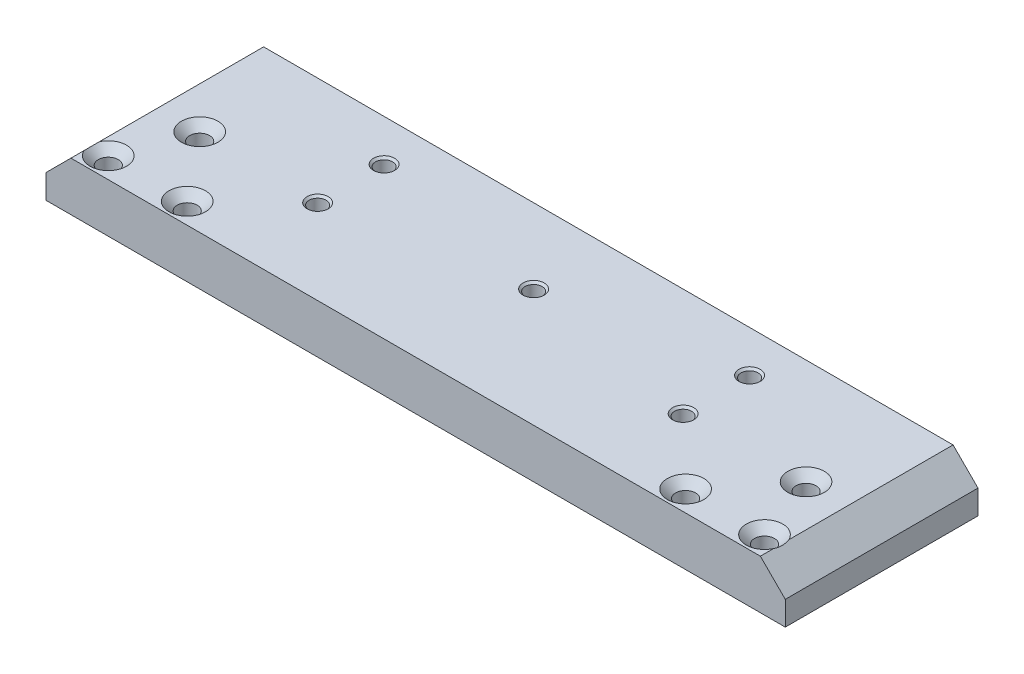
ISO-10303-21;
HEADER;
FILE_DESCRIPTION(('STEP AP214'),'2;1');
FILE_NAME('part.step','',(''),(''),'','','');
FILE_SCHEMA(('AUTOMOTIVE_DESIGN { 1 0 10303 214 1 1 1 1 }'));
ENDSEC;
DATA;
#1=APPLICATION_CONTEXT('core data for automotive mechanical design processes');
#2=APPLICATION_PROTOCOL_DEFINITION('international standard','automotive_design',2000,#1);
#3=PRODUCT_CONTEXT('',#1,'mechanical');
#4=PRODUCT('Part','Part','',(#3));
#5=PRODUCT_RELATED_PRODUCT_CATEGORY('part','',(#4));
#6=PRODUCT_DEFINITION_FORMATION('','',#4);
#7=PRODUCT_DEFINITION_CONTEXT('part definition',#1,'design');
#8=PRODUCT_DEFINITION('design','',#6,#7);
#9=PRODUCT_DEFINITION_SHAPE('','',#8);
#10=(LENGTH_UNIT() NAMED_UNIT(*) SI_UNIT(.MILLI.,.METRE.));
#11=(NAMED_UNIT(*) PLANE_ANGLE_UNIT() SI_UNIT($,.RADIAN.));
#12=(NAMED_UNIT(*) SI_UNIT($,.STERADIAN.) SOLID_ANGLE_UNIT());
#13=UNCERTAINTY_MEASURE_WITH_UNIT(LENGTH_MEASURE(1.E-05),#10,'distance_accuracy_value','');
#14=(GEOMETRIC_REPRESENTATION_CONTEXT(3) GLOBAL_UNCERTAINTY_ASSIGNED_CONTEXT((#13)) GLOBAL_UNIT_ASSIGNED_CONTEXT((#10,
#11,#12)) REPRESENTATION_CONTEXT('',''));
#15=CARTESIAN_POINT('',(0.,0.,0.));
#16=DIRECTION('',(0.,0.,1.));
#17=DIRECTION('',(1.,0.,0.));
#18=AXIS2_PLACEMENT_3D('',#15,#16,#17);
#19=CARTESIAN_POINT('',(-44.5000000000001,-1.9,11.6));
#20=DIRECTION('',(-1.,0.,0.));
#21=DIRECTION('',(0.,0.,1.));
#22=AXIS2_PLACEMENT_3D('',#19,#20,#21);
#23=PLANE('',#22);
#24=DIRECTION('',(0.,0.,1.));
#25=VECTOR('',#24,1.);
#26=CARTESIAN_POINT('',(-44.5000000000001,1.,-15.8426406871193));
#27=LINE('',#26,#25);
#28=CARTESIAN_POINT('',(-44.5000000000001,1.,-11.6));
#29=VERTEX_POINT('',#28);
#30=CARTESIAN_POINT('',(-44.5000000000001,1.,11.6));
#31=VERTEX_POINT('',#30);
#32=EDGE_CURVE('E109',#29,#31,#27,.T.);
#33=ORIENTED_EDGE('',*,*,#32,.F.);
#34=DIRECTION('',(0.,1.,0.));
#35=VECTOR('',#34,1.);
#36=CARTESIAN_POINT('',(-44.5000000000001,-1.9,-11.6));
#37=LINE('',#36,#35);
#38=CARTESIAN_POINT('',(-44.5000000000001,-1.9,-11.6));
#39=VERTEX_POINT('',#38);
#40=EDGE_CURVE('E122',#39,#29,#37,.T.);
#41=ORIENTED_EDGE('',*,*,#40,.F.);
#42=DIRECTION('',(0.,0.,1.));
#43=VECTOR('',#42,1.);
#44=CARTESIAN_POINT('',(-44.5000000000001,-1.9,11.6));
#45=LINE('',#44,#43);
#46=CARTESIAN_POINT('',(-44.5000000000001,-1.9,11.6));
#47=VERTEX_POINT('',#46);
#48=EDGE_CURVE('E359',#39,#47,#45,.T.);
#49=ORIENTED_EDGE('',*,*,#48,.T.);
#50=DIRECTION('',(0.,1.,0.));
#51=VECTOR('',#50,1.);
#52=CARTESIAN_POINT('',(-44.5000000000001,-1.9,11.6));
#53=LINE('',#52,#51);
#54=EDGE_CURVE('E124',#47,#31,#53,.T.);
#55=ORIENTED_EDGE('',*,*,#54,.T.);
#56=EDGE_LOOP('',(#33,#41,#49,#55));
#57=FACE_BOUND('',#56,.T.);
#58=ADVANCED_FACE('F38',(#57),#23,.T.);
#59=CARTESIAN_POINT('',(44.4999999999999,-1.9,-11.6));
#60=DIRECTION('',(0.,0.,-1.));
#61=DIRECTION('',(-1.,0.,0.));
#62=AXIS2_PLACEMENT_3D('',#59,#60,#61);
#63=PLANE('',#62);
#64=DIRECTION('',(0.707106781186548,0.707106781186547,0.));
#65=VECTOR('',#64,1.);
#66=CARTESIAN_POINT('',(-44.5000000000001,1.,-11.6));
#67=LINE('',#66,#65);
#68=CARTESIAN_POINT('',(-41.5000000000001,4.,-11.6));
#69=VERTEX_POINT('',#68);
#70=EDGE_CURVE('E106',#29,#69,#67,.T.);
#71=ORIENTED_EDGE('',*,*,#70,.T.);
#72=DIRECTION('',(-1.,0.,0.));
#73=VECTOR('',#72,1.);
#74=CARTESIAN_POINT('',(44.4999999999999,4.,-11.6));
#75=LINE('',#74,#73);
#76=CARTESIAN_POINT('',(41.4999999999999,4.,-11.6));
#77=VERTEX_POINT('',#76);
#78=EDGE_CURVE('E356',#77,#69,#75,.T.);
#79=ORIENTED_EDGE('',*,*,#78,.F.);
#80=DIRECTION('',(0.707106781186548,-0.707106781186547,0.));
#81=VECTOR('',#80,1.);
#82=CARTESIAN_POINT('',(44.4999999999999,1.,-11.6));
#83=LINE('',#82,#81);
#84=CARTESIAN_POINT('',(44.4999999999999,1.,-11.6));
#85=VERTEX_POINT('',#84);
#86=EDGE_CURVE('E247',#77,#85,#83,.T.);
#87=ORIENTED_EDGE('',*,*,#86,.T.);
#88=DIRECTION('',(0.,1.,0.));
#89=VECTOR('',#88,1.);
#90=CARTESIAN_POINT('',(44.4999999999999,-1.9,-11.6));
#91=LINE('',#90,#89);
#92=CARTESIAN_POINT('',(44.4999999999999,-1.9,-11.6));
#93=VERTEX_POINT('',#92);
#94=EDGE_CURVE('E133',#93,#85,#91,.T.);
#95=ORIENTED_EDGE('',*,*,#94,.F.);
#96=DIRECTION('',(-1.,0.,0.));
#97=VECTOR('',#96,1.);
#98=CARTESIAN_POINT('',(44.4999999999999,-1.9,-11.6));
#99=LINE('',#98,#97);
#100=EDGE_CURVE('E131',#93,#39,#99,.T.);
#101=ORIENTED_EDGE('',*,*,#100,.T.);
#102=ORIENTED_EDGE('',*,*,#40,.T.);
#103=EDGE_LOOP('',(#71,#79,#87,#95,#101,#102));
#104=FACE_BOUND('',#103,.T.);
#105=ADVANCED_FACE('F129',(#104),#63,.T.);
#106=CARTESIAN_POINT('',(44.4999999999999,-1.9,11.6));
#107=DIRECTION('',(1.,0.,0.));
#108=DIRECTION('',(0.,0.,-1.));
#109=AXIS2_PLACEMENT_3D('',#106,#107,#108);
#110=PLANE('',#109);
#111=DIRECTION('',(0.,0.,1.));
#112=VECTOR('',#111,1.);
#113=CARTESIAN_POINT('',(44.4999999999999,1.,-15.8426406871193));
#114=LINE('',#113,#112);
#115=CARTESIAN_POINT('',(44.4999999999999,1.,11.6));
#116=VERTEX_POINT('',#115);
#117=EDGE_CURVE('E243',#85,#116,#114,.T.);
#118=ORIENTED_EDGE('',*,*,#117,.T.);
#119=DIRECTION('',(0.,1.,0.));
#120=VECTOR('',#119,1.);
#121=CARTESIAN_POINT('',(44.4999999999999,-1.9,11.6));
#122=LINE('',#121,#120);
#123=CARTESIAN_POINT('',(44.4999999999999,-1.9,11.6));
#124=VERTEX_POINT('',#123);
#125=EDGE_CURVE('E140',#124,#116,#122,.T.);
#126=ORIENTED_EDGE('',*,*,#125,.F.);
#127=DIRECTION('',(0.,0.,-1.));
#128=VECTOR('',#127,1.);
#129=CARTESIAN_POINT('',(44.4999999999999,-1.9,11.6));
#130=LINE('',#129,#128);
#131=EDGE_CURVE('E364',#124,#93,#130,.T.);
#132=ORIENTED_EDGE('',*,*,#131,.T.);
#133=ORIENTED_EDGE('',*,*,#94,.T.);
#134=EDGE_LOOP('',(#118,#126,#132,#133));
#135=FACE_BOUND('',#134,.T.);
#136=ADVANCED_FACE('F218',(#135),#110,.T.);
#137=CARTESIAN_POINT('',(44.4999999999999,-1.9,11.6));
#138=DIRECTION('',(0.,0.,1.));
#139=DIRECTION('',(1.,0.,0.));
#140=AXIS2_PLACEMENT_3D('',#137,#138,#139);
#141=PLANE('',#140);
#142=DIRECTION('',(0.707106781186548,0.707106781186547,0.));
#143=VECTOR('',#142,1.);
#144=CARTESIAN_POINT('',(-44.5000000000001,1.,11.6));
#145=LINE('',#144,#143);
#146=CARTESIAN_POINT('',(-41.5000000000001,4.,11.6));
#147=VERTEX_POINT('',#146);
#148=EDGE_CURVE('E126',#31,#147,#145,.T.);
#149=ORIENTED_EDGE('',*,*,#148,.F.);
#150=ORIENTED_EDGE('',*,*,#54,.F.);
#151=DIRECTION('',(1.,0.,0.));
#152=VECTOR('',#151,1.);
#153=CARTESIAN_POINT('',(44.4999999999999,-1.9,11.6));
#154=LINE('',#153,#152);
#155=EDGE_CURVE('E362',#47,#124,#154,.T.);
#156=ORIENTED_EDGE('',*,*,#155,.T.);
#157=ORIENTED_EDGE('',*,*,#125,.T.);
#158=DIRECTION('',(0.707106781186548,-0.707106781186547,0.));
#159=VECTOR('',#158,1.);
#160=CARTESIAN_POINT('',(44.4999999999999,1.,11.6));
#161=LINE('',#160,#159);
#162=CARTESIAN_POINT('',(41.4999999999999,4.,11.6));
#163=VERTEX_POINT('',#162);
#164=EDGE_CURVE('E253',#163,#116,#161,.T.);
#165=ORIENTED_EDGE('',*,*,#164,.F.);
#166=DIRECTION('',(1.,0.,0.));
#167=VECTOR('',#166,1.);
#168=CARTESIAN_POINT('',(44.4999999999999,4.,11.6));
#169=LINE('',#168,#167);
#170=EDGE_CURVE('E241',#147,#163,#169,.T.);
#171=ORIENTED_EDGE('',*,*,#170,.F.);
#172=EDGE_LOOP('',(#149,#150,#156,#157,#165,#171));
#173=FACE_BOUND('',#172,.T.);
#174=ADVANCED_FACE('F223',(#173),#141,.T.);
#175=CARTESIAN_POINT('',(0.,-1.9,0.));
#176=DIRECTION('',(0.,1.,0.));
#177=DIRECTION('',(0.,0.,1.));
#178=AXIS2_PLACEMENT_3D('',#175,#176,#177);
#179=PLANE('',#178);
#180=CARTESIAN_POINT('',(-36.5,-1.9,1.1));
#181=DIRECTION('',(0.,1.,0.));
#182=DIRECTION('',(0.,0.,1.));
#183=AXIS2_PLACEMENT_3D('',#180,#181,#182);
#184=CIRCLE('',#183,1.2);
#185=CARTESIAN_POINT('',(-36.5,-1.9,2.3));
#186=VERTEX_POINT('',#185);
#187=EDGE_CURVE('E180',#186,#186,#184,.T.);
#188=ORIENTED_EDGE('',*,*,#187,.T.);
#189=EDGE_LOOP('',(#188));
#190=FACE_BOUND('',#189,.T.);
#191=CARTESIAN_POINT('',(-39.5,-1.9,9.1));
#192=DIRECTION('',(0.,1.,0.));
#193=DIRECTION('',(0.,0.,1.));
#194=AXIS2_PLACEMENT_3D('',#191,#192,#193);
#195=CIRCLE('',#194,1.2);
#196=CARTESIAN_POINT('',(-39.5,-1.9,10.3));
#197=VERTEX_POINT('',#196);
#198=EDGE_CURVE('E174',#197,#197,#195,.T.);
#199=ORIENTED_EDGE('',*,*,#198,.T.);
#200=EDGE_LOOP('',(#199));
#201=FACE_BOUND('',#200,.T.);
#202=CARTESIAN_POINT('',(-30.,-1.9,9.09999999999999));
#203=DIRECTION('',(0.,1.,0.));
#204=DIRECTION('',(0.,0.,1.));
#205=AXIS2_PLACEMENT_3D('',#202,#203,#204);
#206=CIRCLE('',#205,1.2);
#207=CARTESIAN_POINT('',(-30.,-1.9,10.3));
#208=VERTEX_POINT('',#207);
#209=EDGE_CURVE('E168',#208,#208,#206,.T.);
#210=ORIENTED_EDGE('',*,*,#209,.T.);
#211=EDGE_LOOP('',(#210));
#212=FACE_BOUND('',#211,.T.);
#213=CARTESIAN_POINT('',(30.,-1.9,9.1));
#214=DIRECTION('',(0.,1.,0.));
#215=DIRECTION('',(0.,0.,1.));
#216=AXIS2_PLACEMENT_3D('',#213,#214,#215);
#217=CIRCLE('',#216,1.2);
#218=CARTESIAN_POINT('',(30.,-1.9,10.3));
#219=VERTEX_POINT('',#218);
#220=EDGE_CURVE('E162',#219,#219,#217,.T.);
#221=ORIENTED_EDGE('',*,*,#220,.T.);
#222=EDGE_LOOP('',(#221));
#223=FACE_BOUND('',#222,.T.);
#224=CARTESIAN_POINT('',(39.5,-1.9,9.1));
#225=DIRECTION('',(0.,1.,0.));
#226=DIRECTION('',(0.,0.,1.));
#227=AXIS2_PLACEMENT_3D('',#224,#225,#226);
#228=CIRCLE('',#227,1.2);
#229=CARTESIAN_POINT('',(39.5,-1.9,10.3));
#230=VERTEX_POINT('',#229);
#231=EDGE_CURVE('E156',#230,#230,#228,.T.);
#232=ORIENTED_EDGE('',*,*,#231,.T.);
#233=EDGE_LOOP('',(#232));
#234=FACE_BOUND('',#233,.T.);
#235=CARTESIAN_POINT('',(36.5,-1.9,1.1));
#236=DIRECTION('',(0.,1.,0.));
#237=DIRECTION('',(0.,0.,1.));
#238=AXIS2_PLACEMENT_3D('',#235,#236,#237);
#239=CIRCLE('',#238,1.2);
#240=CARTESIAN_POINT('',(36.5,-1.9,2.3));
#241=VERTEX_POINT('',#240);
#242=EDGE_CURVE('E150',#241,#241,#239,.T.);
#243=ORIENTED_EDGE('',*,*,#242,.T.);
#244=EDGE_LOOP('',(#243));
#245=FACE_BOUND('',#244,.T.);
#246=CARTESIAN_POINT('',(-22.,-1.9,-6.59999999999997));
#247=DIRECTION('',(0.,1.,0.));
#248=DIRECTION('',(0.,0.,1.));
#249=AXIS2_PLACEMENT_3D('',#246,#247,#248);
#250=CIRCLE('',#249,1.025);
#251=CARTESIAN_POINT('',(-22.,-1.9,-5.57499999999997));
#252=VERTEX_POINT('',#251);
#253=EDGE_CURVE('E302',#252,#252,#250,.T.);
#254=ORIENTED_EDGE('',*,*,#253,.T.);
#255=EDGE_LOOP('',(#254));
#256=FACE_BOUND('',#255,.T.);
#257=CARTESIAN_POINT('',(-22.,-1.9,1.40000000000003));
#258=DIRECTION('',(0.,1.,0.));
#259=DIRECTION('',(0.,0.,1.));
#260=AXIS2_PLACEMENT_3D('',#257,#258,#259);
#261=CIRCLE('',#260,1.025);
#262=CARTESIAN_POINT('',(-22.,-1.9,2.42500000000003));
#263=VERTEX_POINT('',#262);
#264=EDGE_CURVE('E314',#263,#263,#261,.T.);
#265=ORIENTED_EDGE('',*,*,#264,.T.);
#266=EDGE_LOOP('',(#265));
#267=FACE_BOUND('',#266,.T.);
#268=CARTESIAN_POINT('',(22.,-1.9,1.4));
#269=DIRECTION('',(0.,1.,0.));
#270=DIRECTION('',(0.,0.,1.));
#271=AXIS2_PLACEMENT_3D('',#268,#269,#270);
#272=CIRCLE('',#271,1.025);
#273=CARTESIAN_POINT('',(22.,-1.9,2.425));
#274=VERTEX_POINT('',#273);
#275=EDGE_CURVE('E326',#274,#274,#272,.T.);
#276=ORIENTED_EDGE('',*,*,#275,.T.);
#277=EDGE_LOOP('',(#276));
#278=FACE_BOUND('',#277,.T.);
#279=CARTESIAN_POINT('',(22.,-1.9,-6.6));
#280=DIRECTION('',(0.,1.,0.));
#281=DIRECTION('',(0.,0.,1.));
#282=AXIS2_PLACEMENT_3D('',#279,#280,#281);
#283=CIRCLE('',#282,1.025);
#284=CARTESIAN_POINT('',(22.,-1.9,-5.575));
#285=VERTEX_POINT('',#284);
#286=EDGE_CURVE('E338',#285,#285,#283,.T.);
#287=ORIENTED_EDGE('',*,*,#286,.T.);
#288=EDGE_LOOP('',(#287));
#289=FACE_BOUND('',#288,.T.);
#290=CARTESIAN_POINT('',(0.,-1.9,-2.6));
#291=DIRECTION('',(0.,1.,0.));
#292=DIRECTION('',(0.,0.,1.));
#293=AXIS2_PLACEMENT_3D('',#290,#291,#292);
#294=CIRCLE('',#293,1.025);
#295=CARTESIAN_POINT('',(0.,-1.9,-1.575));
#296=VERTEX_POINT('',#295);
#297=EDGE_CURVE('E350',#296,#296,#294,.T.);
#298=ORIENTED_EDGE('',*,*,#297,.T.);
#299=EDGE_LOOP('',(#298));
#300=FACE_BOUND('',#299,.T.);
#301=ORIENTED_EDGE('',*,*,#48,.F.);
#302=ORIENTED_EDGE('',*,*,#100,.F.);
#303=ORIENTED_EDGE('',*,*,#131,.F.);
#304=ORIENTED_EDGE('',*,*,#155,.F.);
#305=EDGE_LOOP('',(#301,#302,#303,#304));
#306=FACE_BOUND('',#305,.T.);
#307=ADVANCED_FACE('F227',(#190,#201,#212,#223,#234,#245,#256,#267,#278,#289,#300,#306),#179,.F.);
#308=CARTESIAN_POINT('',(0.,4.,0.));
#309=DIRECTION('',(0.,1.,0.));
#310=DIRECTION('',(0.,0.,1.));
#311=AXIS2_PLACEMENT_3D('',#308,#309,#310);
#312=PLANE('',#311);
#313=DIRECTION('',(0.,0.,1.));
#314=VECTOR('',#313,1.);
#315=CARTESIAN_POINT('',(-41.5000000000001,4.,-15.8426406871193));
#316=LINE('',#315,#314);
#317=CARTESIAN_POINT('',(-41.5000000000001,4.,10.0165151389909));
#318=VERTEX_POINT('',#317);
#319=EDGE_CURVE('E66',#318,#147,#316,.T.);
#320=ORIENTED_EDGE('',*,*,#319,.T.);
#321=ORIENTED_EDGE('',*,*,#170,.T.);
#322=DIRECTION('',(0.,0.,1.));
#323=VECTOR('',#322,1.);
#324=CARTESIAN_POINT('',(41.4999999999999,4.,-15.8426406871193));
#325=LINE('',#324,#323);
#326=CARTESIAN_POINT('',(41.4999999999999,4.,10.0165151389914));
#327=VERTEX_POINT('',#326);
#328=EDGE_CURVE('E255',#327,#163,#325,.T.);
#329=ORIENTED_EDGE('',*,*,#328,.F.);
#330=CARTESIAN_POINT('',(39.5,4.,9.1));
#331=DIRECTION('',(0.,1.,0.));
#332=DIRECTION('',(0.,0.,1.));
#333=AXIS2_PLACEMENT_3D('',#330,#331,#332);
#334=CIRCLE('',#333,2.2);
#335=CARTESIAN_POINT('',(41.4999999999999,4.,8.18348486100856));
#336=VERTEX_POINT('',#335);
#337=EDGE_CURVE('E166',#336,#327,#334,.T.);
#338=ORIENTED_EDGE('',*,*,#337,.F.);
#339=EDGE_CURVE('E59',#77,#336,#325,.T.);
#340=ORIENTED_EDGE('',*,*,#339,.F.);
#341=ORIENTED_EDGE('',*,*,#78,.T.);
#342=CARTESIAN_POINT('',(-41.5000000000001,4.,8.18348486100908));
#343=VERTEX_POINT('',#342);
#344=EDGE_CURVE('E112',#69,#343,#316,.T.);
#345=ORIENTED_EDGE('',*,*,#344,.T.);
#346=CARTESIAN_POINT('',(-39.5,4.,9.1));
#347=DIRECTION('',(0.,1.,0.));
#348=DIRECTION('',(0.,0.,1.));
#349=AXIS2_PLACEMENT_3D('',#346,#347,#348);
#350=CIRCLE('',#349,2.2);
#351=EDGE_CURVE('E183',#318,#343,#350,.T.);
#352=ORIENTED_EDGE('',*,*,#351,.F.);
#353=EDGE_LOOP('',(#320,#321,#329,#338,#340,#341,#345,#352));
#354=FACE_BOUND('',#353,.T.);
#355=CARTESIAN_POINT('',(-36.5,4.,1.1));
#356=DIRECTION('',(0.,1.,0.));
#357=DIRECTION('',(0.,0.,1.));
#358=AXIS2_PLACEMENT_3D('',#355,#356,#357);
#359=CIRCLE('',#358,2.2);
#360=CARTESIAN_POINT('',(-36.5,4.,3.3));
#361=VERTEX_POINT('',#360);
#362=EDGE_CURVE('E251',#361,#361,#359,.T.);
#363=ORIENTED_EDGE('',*,*,#362,.F.);
#364=EDGE_LOOP('',(#363));
#365=FACE_BOUND('',#364,.T.);
#366=CARTESIAN_POINT('',(-30.,4.,9.09999999999999));
#367=DIRECTION('',(0.,1.,0.));
#368=DIRECTION('',(0.,0.,1.));
#369=AXIS2_PLACEMENT_3D('',#366,#367,#368);
#370=CIRCLE('',#369,2.2);
#371=CARTESIAN_POINT('',(-30.,4.,11.3));
#372=VERTEX_POINT('',#371);
#373=EDGE_CURVE('E178',#372,#372,#370,.T.);
#374=ORIENTED_EDGE('',*,*,#373,.F.);
#375=EDGE_LOOP('',(#374));
#376=FACE_BOUND('',#375,.T.);
#377=CARTESIAN_POINT('',(30.,4.,9.1));
#378=DIRECTION('',(0.,1.,0.));
#379=DIRECTION('',(0.,0.,1.));
#380=AXIS2_PLACEMENT_3D('',#377,#378,#379);
#381=CIRCLE('',#380,2.2);
#382=CARTESIAN_POINT('',(30.,4.,11.3));
#383=VERTEX_POINT('',#382);
#384=EDGE_CURVE('E172',#383,#383,#381,.T.);
#385=ORIENTED_EDGE('',*,*,#384,.F.);
#386=EDGE_LOOP('',(#385));
#387=FACE_BOUND('',#386,.T.);
#388=CARTESIAN_POINT('',(36.5,4.,1.1));
#389=DIRECTION('',(0.,1.,0.));
#390=DIRECTION('',(0.,0.,1.));
#391=AXIS2_PLACEMENT_3D('',#388,#389,#390);
#392=CIRCLE('',#391,2.2);
#393=CARTESIAN_POINT('',(36.5,4.,3.3));
#394=VERTEX_POINT('',#393);
#395=EDGE_CURVE('E160',#394,#394,#392,.T.);
#396=ORIENTED_EDGE('',*,*,#395,.F.);
#397=EDGE_LOOP('',(#396));
#398=FACE_BOUND('',#397,.T.);
#399=CARTESIAN_POINT('',(-22.,4.,-6.59999999999997));
#400=DIRECTION('',(0.,1.,0.));
#401=DIRECTION('',(0.,0.,1.));
#402=AXIS2_PLACEMENT_3D('',#399,#400,#401);
#403=CIRCLE('',#402,1.275);
#404=CARTESIAN_POINT('',(-22.,4.,-5.32499999999997));
#405=VERTEX_POINT('',#404);
#406=EDGE_CURVE('E154',#405,#405,#403,.T.);
#407=ORIENTED_EDGE('',*,*,#406,.F.);
#408=EDGE_LOOP('',(#407));
#409=FACE_BOUND('',#408,.T.);
#410=CARTESIAN_POINT('',(-22.,4.,1.40000000000003));
#411=DIRECTION('',(0.,1.,0.));
#412=DIRECTION('',(0.,0.,1.));
#413=AXIS2_PLACEMENT_3D('',#410,#411,#412);
#414=CIRCLE('',#413,1.275);
#415=CARTESIAN_POINT('',(-22.,4.,2.67500000000003));
#416=VERTEX_POINT('',#415);
#417=EDGE_CURVE('E306',#416,#416,#414,.T.);
#418=ORIENTED_EDGE('',*,*,#417,.F.);
#419=EDGE_LOOP('',(#418));
#420=FACE_BOUND('',#419,.T.);
#421=CARTESIAN_POINT('',(22.,4.,1.4));
#422=DIRECTION('',(0.,1.,0.));
#423=DIRECTION('',(0.,0.,1.));
#424=AXIS2_PLACEMENT_3D('',#421,#422,#423);
#425=CIRCLE('',#424,1.275);
#426=CARTESIAN_POINT('',(22.,4.,2.675));
#427=VERTEX_POINT('',#426);
#428=EDGE_CURVE('E318',#427,#427,#425,.T.);
#429=ORIENTED_EDGE('',*,*,#428,.F.);
#430=EDGE_LOOP('',(#429));
#431=FACE_BOUND('',#430,.T.);
#432=CARTESIAN_POINT('',(22.,4.,-6.6));
#433=DIRECTION('',(0.,1.,0.));
#434=DIRECTION('',(0.,0.,1.));
#435=AXIS2_PLACEMENT_3D('',#432,#433,#434);
#436=CIRCLE('',#435,1.275);
#437=CARTESIAN_POINT('',(22.,4.,-5.325));
#438=VERTEX_POINT('',#437);
#439=EDGE_CURVE('E330',#438,#438,#436,.T.);
#440=ORIENTED_EDGE('',*,*,#439,.F.);
#441=EDGE_LOOP('',(#440));
#442=FACE_BOUND('',#441,.T.);
#443=CARTESIAN_POINT('',(0.,4.,-2.6));
#444=DIRECTION('',(0.,1.,0.));
#445=DIRECTION('',(0.,0.,1.));
#446=AXIS2_PLACEMENT_3D('',#443,#444,#445);
#447=CIRCLE('',#446,1.275);
#448=CARTESIAN_POINT('',(0.,4.,-1.325));
#449=VERTEX_POINT('',#448);
#450=EDGE_CURVE('E342',#449,#449,#447,.T.);
#451=ORIENTED_EDGE('',*,*,#450,.F.);
#452=EDGE_LOOP('',(#451));
#453=FACE_BOUND('',#452,.T.);
#454=ADVANCED_FACE('F234',(#354,#365,#376,#387,#398,#409,#420,#431,#442,#453),#312,.T.);
#455=CARTESIAN_POINT('',(0.,4.,-2.6));
#456=DIRECTION('',(0.,1.,0.));
#457=DIRECTION('',(0.,0.,1.));
#458=AXIS2_PLACEMENT_3D('',#455,#456,#457);
#459=CYLINDRICAL_SURFACE('',#458,1.025);
#460=ORIENTED_EDGE('',*,*,#297,.F.);
#461=EDGE_LOOP('',(#460));
#462=FACE_BOUND('',#461,.T.);
#463=CARTESIAN_POINT('',(0.,3.75,-2.6));
#464=DIRECTION('',(0.,1.,0.));
#465=DIRECTION('',(0.,0.,1.));
#466=AXIS2_PLACEMENT_3D('',#463,#464,#465);
#467=CIRCLE('',#466,1.025);
#468=CARTESIAN_POINT('',(0.,3.75,-1.575));
#469=VERTEX_POINT('',#468);
#470=EDGE_CURVE('E346',#469,#469,#467,.T.);
#471=ORIENTED_EDGE('',*,*,#470,.T.);
#472=EDGE_LOOP('',(#471));
#473=FACE_BOUND('',#472,.T.);
#474=ADVANCED_FACE('F440',(#462,#473),#459,.F.);
#475=CARTESIAN_POINT('',(0.,4.,-2.6));
#476=DIRECTION('',(0.,1.,0.));
#477=DIRECTION('',(0.,0.,1.));
#478=AXIS2_PLACEMENT_3D('',#475,#476,#477);
#479=CONICAL_SURFACE('',#478,1.275,0.785398163397447);
#480=ORIENTED_EDGE('',*,*,#470,.F.);
#481=EDGE_LOOP('',(#480));
#482=FACE_BOUND('',#481,.T.);
#483=ORIENTED_EDGE('',*,*,#450,.T.);
#484=EDGE_LOOP('',(#483));
#485=FACE_BOUND('',#484,.T.);
#486=ADVANCED_FACE('F436',(#482,#485),#479,.F.);
#487=CARTESIAN_POINT('',(22.,4.,-6.6));
#488=DIRECTION('',(0.,1.,0.));
#489=DIRECTION('',(0.,0.,1.));
#490=AXIS2_PLACEMENT_3D('',#487,#488,#489);
#491=CYLINDRICAL_SURFACE('',#490,1.025);
#492=ORIENTED_EDGE('',*,*,#286,.F.);
#493=EDGE_LOOP('',(#492));
#494=FACE_BOUND('',#493,.T.);
#495=CARTESIAN_POINT('',(22.,3.75,-6.6));
#496=DIRECTION('',(0.,1.,0.));
#497=DIRECTION('',(0.,0.,1.));
#498=AXIS2_PLACEMENT_3D('',#495,#496,#497);
#499=CIRCLE('',#498,1.025);
#500=CARTESIAN_POINT('',(22.,3.75,-5.575));
#501=VERTEX_POINT('',#500);
#502=EDGE_CURVE('E334',#501,#501,#499,.T.);
#503=ORIENTED_EDGE('',*,*,#502,.T.);
#504=EDGE_LOOP('',(#503));
#505=FACE_BOUND('',#504,.T.);
#506=ADVANCED_FACE('F432',(#494,#505),#491,.F.);
#507=CARTESIAN_POINT('',(22.,4.,-6.6));
#508=DIRECTION('',(0.,1.,0.));
#509=DIRECTION('',(0.,0.,1.));
#510=AXIS2_PLACEMENT_3D('',#507,#508,#509);
#511=CONICAL_SURFACE('',#510,1.275,0.785398163397445);
#512=ORIENTED_EDGE('',*,*,#502,.F.);
#513=EDGE_LOOP('',(#512));
#514=FACE_BOUND('',#513,.T.);
#515=ORIENTED_EDGE('',*,*,#439,.T.);
#516=EDGE_LOOP('',(#515));
#517=FACE_BOUND('',#516,.T.);
#518=ADVANCED_FACE('F428',(#514,#517),#511,.F.);
#519=CARTESIAN_POINT('',(22.,4.,1.4));
#520=DIRECTION('',(0.,1.,0.));
#521=DIRECTION('',(0.,0.,1.));
#522=AXIS2_PLACEMENT_3D('',#519,#520,#521);
#523=CYLINDRICAL_SURFACE('',#522,1.025);
#524=ORIENTED_EDGE('',*,*,#275,.F.);
#525=EDGE_LOOP('',(#524));
#526=FACE_BOUND('',#525,.T.);
#527=CARTESIAN_POINT('',(22.,3.75,1.4));
#528=DIRECTION('',(0.,1.,0.));
#529=DIRECTION('',(0.,0.,1.));
#530=AXIS2_PLACEMENT_3D('',#527,#528,#529);
#531=CIRCLE('',#530,1.025);
#532=CARTESIAN_POINT('',(22.,3.75,2.425));
#533=VERTEX_POINT('',#532);
#534=EDGE_CURVE('E322',#533,#533,#531,.T.);
#535=ORIENTED_EDGE('',*,*,#534,.T.);
#536=EDGE_LOOP('',(#535));
#537=FACE_BOUND('',#536,.T.);
#538=ADVANCED_FACE('F424',(#526,#537),#523,.F.);
#539=CARTESIAN_POINT('',(22.,4.,1.4));
#540=DIRECTION('',(0.,1.,0.));
#541=DIRECTION('',(0.,0.,1.));
#542=AXIS2_PLACEMENT_3D('',#539,#540,#541);
#543=CONICAL_SURFACE('',#542,1.275,0.785398163397445);
#544=ORIENTED_EDGE('',*,*,#534,.F.);
#545=EDGE_LOOP('',(#544));
#546=FACE_BOUND('',#545,.T.);
#547=ORIENTED_EDGE('',*,*,#428,.T.);
#548=EDGE_LOOP('',(#547));
#549=FACE_BOUND('',#548,.T.);
#550=ADVANCED_FACE('F420',(#546,#549),#543,.F.);
#551=CARTESIAN_POINT('',(-22.,4.,1.40000000000003));
#552=DIRECTION('',(0.,1.,0.));
#553=DIRECTION('',(0.,0.,1.));
#554=AXIS2_PLACEMENT_3D('',#551,#552,#553);
#555=CYLINDRICAL_SURFACE('',#554,1.025);
#556=ORIENTED_EDGE('',*,*,#264,.F.);
#557=EDGE_LOOP('',(#556));
#558=FACE_BOUND('',#557,.T.);
#559=CARTESIAN_POINT('',(-22.,3.75,1.40000000000003));
#560=DIRECTION('',(0.,1.,0.));
#561=DIRECTION('',(0.,0.,1.));
#562=AXIS2_PLACEMENT_3D('',#559,#560,#561);
#563=CIRCLE('',#562,1.025);
#564=CARTESIAN_POINT('',(-22.,3.75,2.42500000000003));
#565=VERTEX_POINT('',#564);
#566=EDGE_CURVE('E310',#565,#565,#563,.T.);
#567=ORIENTED_EDGE('',*,*,#566,.T.);
#568=EDGE_LOOP('',(#567));
#569=FACE_BOUND('',#568,.T.);
#570=ADVANCED_FACE('F416',(#558,#569),#555,.F.);
#571=CARTESIAN_POINT('',(-22.,4.,1.40000000000003));
#572=DIRECTION('',(0.,1.,0.));
#573=DIRECTION('',(0.,0.,1.));
#574=AXIS2_PLACEMENT_3D('',#571,#572,#573);
#575=CONICAL_SURFACE('',#574,1.275,0.785398163397445);
#576=ORIENTED_EDGE('',*,*,#566,.F.);
#577=EDGE_LOOP('',(#576));
#578=FACE_BOUND('',#577,.T.);
#579=ORIENTED_EDGE('',*,*,#417,.T.);
#580=EDGE_LOOP('',(#579));
#581=FACE_BOUND('',#580,.T.);
#582=ADVANCED_FACE('F412',(#578,#581),#575,.F.);
#583=CARTESIAN_POINT('',(-22.,4.,-6.59999999999997));
#584=DIRECTION('',(0.,1.,0.));
#585=DIRECTION('',(0.,0.,1.));
#586=AXIS2_PLACEMENT_3D('',#583,#584,#585);
#587=CYLINDRICAL_SURFACE('',#586,1.025);
#588=ORIENTED_EDGE('',*,*,#253,.F.);
#589=EDGE_LOOP('',(#588));
#590=FACE_BOUND('',#589,.T.);
#591=CARTESIAN_POINT('',(-22.,3.75,-6.59999999999997));
#592=DIRECTION('',(0.,1.,0.));
#593=DIRECTION('',(0.,0.,1.));
#594=AXIS2_PLACEMENT_3D('',#591,#592,#593);
#595=CIRCLE('',#594,1.025);
#596=CARTESIAN_POINT('',(-22.,3.75,-5.57499999999997));
#597=VERTEX_POINT('',#596);
#598=EDGE_CURVE('E298',#597,#597,#595,.T.);
#599=ORIENTED_EDGE('',*,*,#598,.T.);
#600=EDGE_LOOP('',(#599));
#601=FACE_BOUND('',#600,.T.);
#602=ADVANCED_FACE('F408',(#590,#601),#587,.F.);
#603=CARTESIAN_POINT('',(-22.,4.,-6.59999999999997));
#604=DIRECTION('',(0.,1.,0.));
#605=DIRECTION('',(0.,0.,1.));
#606=AXIS2_PLACEMENT_3D('',#603,#604,#605);
#607=CONICAL_SURFACE('',#606,1.275,0.785398163397445);
#608=ORIENTED_EDGE('',*,*,#598,.F.);
#609=EDGE_LOOP('',(#608));
#610=FACE_BOUND('',#609,.T.);
#611=ORIENTED_EDGE('',*,*,#406,.T.);
#612=EDGE_LOOP('',(#611));
#613=FACE_BOUND('',#612,.T.);
#614=ADVANCED_FACE('F404',(#610,#613),#607,.F.);
#615=CARTESIAN_POINT('',(36.5,4.,1.1));
#616=DIRECTION('',(0.,1.,0.));
#617=DIRECTION('',(0.,0.,1.));
#618=AXIS2_PLACEMENT_3D('',#615,#616,#617);
#619=CYLINDRICAL_SURFACE('',#618,1.2);
#620=CARTESIAN_POINT('',(36.5,3.,1.1));
#621=DIRECTION('',(0.,1.,0.));
#622=DIRECTION('',(0.,0.,1.));
#623=AXIS2_PLACEMENT_3D('',#620,#621,#622);
#624=CIRCLE('',#623,1.2);
#625=CARTESIAN_POINT('',(36.5,3.,2.3));
#626=VERTEX_POINT('',#625);
#627=EDGE_CURVE('E155',#626,#626,#624,.T.);
#628=ORIENTED_EDGE('',*,*,#627,.T.);
#629=EDGE_LOOP('',(#628));
#630=FACE_BOUND('',#629,.T.);
#631=ORIENTED_EDGE('',*,*,#242,.F.);
#632=EDGE_LOOP('',(#631));
#633=FACE_BOUND('',#632,.T.);
#634=ADVANCED_FACE('F400',(#630,#633),#619,.F.);
#635=CARTESIAN_POINT('',(36.5,4.,1.1));
#636=DIRECTION('',(0.,1.,0.));
#637=DIRECTION('',(0.,0.,1.));
#638=AXIS2_PLACEMENT_3D('',#635,#636,#637);
#639=CONICAL_SURFACE('',#638,2.2,0.785398163397449);
#640=ORIENTED_EDGE('',*,*,#627,.F.);
#641=EDGE_LOOP('',(#640));
#642=FACE_BOUND('',#641,.T.);
#643=ORIENTED_EDGE('',*,*,#395,.T.);
#644=EDGE_LOOP('',(#643));
#645=FACE_BOUND('',#644,.T.);
#646=ADVANCED_FACE('F391',(#642,#645),#639,.F.);
#647=CARTESIAN_POINT('',(39.5,4.,9.1));
#648=DIRECTION('',(0.,1.,0.));
#649=DIRECTION('',(0.,0.,1.));
#650=AXIS2_PLACEMENT_3D('',#647,#648,#649);
#651=CYLINDRICAL_SURFACE('',#650,1.2);
#652=CARTESIAN_POINT('',(39.5,3.,9.1));
#653=DIRECTION('',(0.,1.,0.));
#654=DIRECTION('',(0.,0.,1.));
#655=AXIS2_PLACEMENT_3D('',#652,#653,#654);
#656=CIRCLE('',#655,1.2);
#657=CARTESIAN_POINT('',(39.5,3.,10.3));
#658=VERTEX_POINT('',#657);
#659=EDGE_CURVE('E161',#658,#658,#656,.T.);
#660=ORIENTED_EDGE('',*,*,#659,.T.);
#661=EDGE_LOOP('',(#660));
#662=FACE_BOUND('',#661,.T.);
#663=ORIENTED_EDGE('',*,*,#231,.F.);
#664=EDGE_LOOP('',(#663));
#665=FACE_BOUND('',#664,.T.);
#666=ADVANCED_FACE('F382',(#662,#665),#651,.F.);
#667=CARTESIAN_POINT('',(39.5,4.,9.1));
#668=DIRECTION('',(0.,1.,0.));
#669=DIRECTION('',(0.,0.,1.));
#670=AXIS2_PLACEMENT_3D('',#667,#668,#669);
#671=CONICAL_SURFACE('',#670,2.2,0.785398163397449);
#672=ORIENTED_EDGE('',*,*,#659,.F.);
#673=EDGE_LOOP('',(#672));
#674=FACE_BOUND('',#673,.T.);
#675=ORIENTED_EDGE('',*,*,#337,.T.);
#676=CARTESIAN_POINT('',(41.4997999999999,4.0002,10.0174311963305));
#677=CARTESIAN_POINT('',(41.5186607027401,3.98133929725982,9.93119854674425));
#678=CARTESIAN_POINT('',(41.5350606969611,3.96493930303878,9.84385301485825));
#679=CARTESIAN_POINT('',(41.5625862829084,3.9374137170915,9.66745574589303));
#680=CARTESIAN_POINT('',(41.5737081281472,3.92629187185268,9.57840284341195));
#681=CARTESIAN_POINT('',(41.5900796982388,3.90992030176109,9.4015776696926));
#682=CARTESIAN_POINT('',(41.5954754187039,3.90452458129593,9.31383283507634));
#683=CARTESIAN_POINT('',(41.6007473941141,3.89925260588576,9.13807337248195));
#684=CARTESIAN_POINT('',(41.6006265538911,3.89937344610882,9.05005891089471));
#685=CARTESIAN_POINT('',(41.5934391035457,3.90656089645422,8.83133596045331));
#686=CARTESIAN_POINT('',(41.5830025077952,3.91699749220472,8.70081145681737));
#687=CARTESIAN_POINT('',(41.5585200519586,3.94147994804124,8.50603631714315));
#688=CARTESIAN_POINT('',(41.5487443607212,3.95125563927871,8.44063172929212));
#689=CARTESIAN_POINT('',(41.5263568998417,3.97364310015822,8.31081767592273));
#690=CARTESIAN_POINT('',(41.5137459121779,3.98625408782194,8.24640794124725));
#691=CARTESIAN_POINT('',(41.4997999999999,4.0002,8.18256880366946));
#692=B_SPLINE_CURVE_WITH_KNOTS('',3,(#676,#677,#678,#679,#680,#681,#682,#683,#684,#685,#686,
#687,#688,#689,#690,#691),.UNSPECIFIED.,.F.,.F.,(4,2,2,2,2,2,2,4),(0.,0.270770000784234,
0.541731910649757,0.805605860102779,1.06934086417387,1.46213497650307,1.66257915012522,
1.86296810866082),.UNSPECIFIED.);
#693=EDGE_CURVE('E11',#327,#336,#692,.T.);
#694=ORIENTED_EDGE('',*,*,#693,.T.);
#695=EDGE_LOOP('',(#675,#694));
#696=FACE_BOUND('',#695,.T.);
#697=ADVANCED_FACE('F379',(#674,#696),#671,.F.);
#698=CARTESIAN_POINT('',(30.,4.,9.1));
#699=DIRECTION('',(0.,1.,0.));
#700=DIRECTION('',(0.,0.,1.));
#701=AXIS2_PLACEMENT_3D('',#698,#699,#700);
#702=CYLINDRICAL_SURFACE('',#701,1.2);
#703=CARTESIAN_POINT('',(30.,3.,9.1));
#704=DIRECTION('',(0.,1.,0.));
#705=DIRECTION('',(0.,0.,1.));
#706=AXIS2_PLACEMENT_3D('',#703,#704,#705);
#707=CIRCLE('',#706,1.2);
#708=CARTESIAN_POINT('',(30.,3.,10.3));
#709=VERTEX_POINT('',#708);
#710=EDGE_CURVE('E167',#709,#709,#707,.T.);
#711=ORIENTED_EDGE('',*,*,#710,.T.);
#712=EDGE_LOOP('',(#711));
#713=FACE_BOUND('',#712,.T.);
#714=ORIENTED_EDGE('',*,*,#220,.F.);
#715=EDGE_LOOP('',(#714));
#716=FACE_BOUND('',#715,.T.);
#717=ADVANCED_FACE('F381',(#713,#716),#702,.F.);
#718=CARTESIAN_POINT('',(30.,4.,9.1));
#719=DIRECTION('',(0.,1.,0.));
#720=DIRECTION('',(0.,0.,1.));
#721=AXIS2_PLACEMENT_3D('',#718,#719,#720);
#722=CONICAL_SURFACE('',#721,2.2,0.785398163397449);
#723=ORIENTED_EDGE('',*,*,#710,.F.);
#724=EDGE_LOOP('',(#723));
#725=FACE_BOUND('',#724,.T.);
#726=ORIENTED_EDGE('',*,*,#384,.T.);
#727=EDGE_LOOP('',(#726));
#728=FACE_BOUND('',#727,.T.);
#729=ADVANCED_FACE('F388',(#725,#728),#722,.F.);
#730=CARTESIAN_POINT('',(-30.,4.,9.09999999999999));
#731=DIRECTION('',(0.,1.,0.));
#732=DIRECTION('',(0.,0.,1.));
#733=AXIS2_PLACEMENT_3D('',#730,#731,#732);
#734=CYLINDRICAL_SURFACE('',#733,1.2);
#735=CARTESIAN_POINT('',(-30.,3.,9.09999999999999));
#736=DIRECTION('',(0.,1.,0.));
#737=DIRECTION('',(0.,0.,1.));
#738=AXIS2_PLACEMENT_3D('',#735,#736,#737);
#739=CIRCLE('',#738,1.2);
#740=CARTESIAN_POINT('',(-30.,3.,10.3));
#741=VERTEX_POINT('',#740);
#742=EDGE_CURVE('E173',#741,#741,#739,.T.);
#743=ORIENTED_EDGE('',*,*,#742,.T.);
#744=EDGE_LOOP('',(#743));
#745=FACE_BOUND('',#744,.T.);
#746=ORIENTED_EDGE('',*,*,#209,.F.);
#747=EDGE_LOOP('',(#746));
#748=FACE_BOUND('',#747,.T.);
#749=ADVANCED_FACE('F504',(#745,#748),#734,.F.);
#750=CARTESIAN_POINT('',(-30.,4.,9.09999999999999));
#751=DIRECTION('',(0.,1.,0.));
#752=DIRECTION('',(0.,0.,1.));
#753=AXIS2_PLACEMENT_3D('',#750,#751,#752);
#754=CONICAL_SURFACE('',#753,2.2,0.785398163397449);
#755=ORIENTED_EDGE('',*,*,#742,.F.);
#756=EDGE_LOOP('',(#755));
#757=FACE_BOUND('',#756,.T.);
#758=ORIENTED_EDGE('',*,*,#373,.T.);
#759=EDGE_LOOP('',(#758));
#760=FACE_BOUND('',#759,.T.);
#761=ADVANCED_FACE('F512',(#757,#760),#754,.F.);
#762=CARTESIAN_POINT('',(-39.5,4.,9.1));
#763=DIRECTION('',(0.,1.,0.));
#764=DIRECTION('',(0.,0.,1.));
#765=AXIS2_PLACEMENT_3D('',#762,#763,#764);
#766=CYLINDRICAL_SURFACE('',#765,1.2);
#767=CARTESIAN_POINT('',(-39.5,3.,9.1));
#768=DIRECTION('',(0.,1.,0.));
#769=DIRECTION('',(0.,0.,1.));
#770=AXIS2_PLACEMENT_3D('',#767,#768,#769);
#771=CIRCLE('',#770,1.2);
#772=CARTESIAN_POINT('',(-39.5,3.,10.3));
#773=VERTEX_POINT('',#772);
#774=EDGE_CURVE('E179',#773,#773,#771,.T.);
#775=ORIENTED_EDGE('',*,*,#774,.T.);
#776=EDGE_LOOP('',(#775));
#777=FACE_BOUND('',#776,.T.);
#778=ORIENTED_EDGE('',*,*,#198,.F.);
#779=EDGE_LOOP('',(#778));
#780=FACE_BOUND('',#779,.T.);
#781=ADVANCED_FACE('F210',(#777,#780),#766,.F.);
#782=CARTESIAN_POINT('',(-39.5,4.,9.1));
#783=DIRECTION('',(0.,1.,0.));
#784=DIRECTION('',(0.,0.,1.));
#785=AXIS2_PLACEMENT_3D('',#782,#783,#784);
#786=CONICAL_SURFACE('',#785,2.2,0.785398163397449);
#787=ORIENTED_EDGE('',*,*,#774,.F.);
#788=EDGE_LOOP('',(#787));
#789=FACE_BOUND('',#788,.T.);
#790=ORIENTED_EDGE('',*,*,#351,.T.);
#791=CARTESIAN_POINT('',(-41.4998000000001,4.0002,8.18256880366997));
#792=CARTESIAN_POINT('',(-41.5186607027403,3.98133929725983,8.26880145325626));
#793=CARTESIAN_POINT('',(-41.5350606969613,3.9649393030388,8.35614698514226));
#794=CARTESIAN_POINT('',(-41.5625862829086,3.93741371709155,8.53254425410747));
#795=CARTESIAN_POINT('',(-41.5737081281474,3.92629187185274,8.62159715658855));
#796=CARTESIAN_POINT('',(-41.5900796982389,3.90992030176117,8.7984223303079));
#797=CARTESIAN_POINT('',(-41.5954754187041,3.90452458129602,8.88616716492415));
#798=CARTESIAN_POINT('',(-41.6007473941142,3.89925260588588,9.06192662751853));
#799=CARTESIAN_POINT('',(-41.6006265538912,3.89937344610894,9.14994108910578));
#800=CARTESIAN_POINT('',(-41.5934391035457,3.90656089645437,9.368664039547));
#801=CARTESIAN_POINT('',(-41.5830025077953,3.91699749220486,9.49918854318277));
#802=CARTESIAN_POINT('',(-41.5585200519588,3.94147994804134,9.69396368285675));
#803=CARTESIAN_POINT('',(-41.5487443607213,3.95125563927879,9.75936827070769));
#804=CARTESIAN_POINT('',(-41.5263568998418,3.97364310015827,9.88918232407691));
#805=CARTESIAN_POINT('',(-41.5137459121781,3.98625408782197,9.95359205875231));
#806=CARTESIAN_POINT('',(-41.4998000000001,4.0002,10.01743119633));
#807=B_SPLINE_CURVE_WITH_KNOTS('',3,(#791,#792,#793,#794,#795,#796,#797,#798,#799,#800,#801,
#802,#803,#804,#805,#806),.UNSPECIFIED.,.F.,.F.,(4,2,2,2,2,2,2,4),(0.,0.270770000784215,
0.541731910649721,0.805605860102729,1.06934086417381,1.46213497650251,1.6625791501244,
1.86296810865974),.UNSPECIFIED.);
#808=EDGE_CURVE('E52',#343,#318,#807,.T.);
#809=ORIENTED_EDGE('',*,*,#808,.T.);
#810=EDGE_LOOP('',(#790,#809));
#811=FACE_BOUND('',#810,.T.);
#812=ADVANCED_FACE('F191',(#789,#811),#786,.F.);
#813=CARTESIAN_POINT('',(-36.5,4.,1.1));
#814=DIRECTION('',(0.,1.,0.));
#815=DIRECTION('',(0.,0.,1.));
#816=AXIS2_PLACEMENT_3D('',#813,#814,#815);
#817=CYLINDRICAL_SURFACE('',#816,1.2);
#818=CARTESIAN_POINT('',(-36.5,3.,1.1));
#819=DIRECTION('',(0.,1.,0.));
#820=DIRECTION('',(0.,0.,1.));
#821=AXIS2_PLACEMENT_3D('',#818,#819,#820);
#822=CIRCLE('',#821,1.2);
#823=CARTESIAN_POINT('',(-36.5,3.,2.3));
#824=VERTEX_POINT('',#823);
#825=EDGE_CURVE('E184',#824,#824,#822,.T.);
#826=ORIENTED_EDGE('',*,*,#825,.T.);
#827=EDGE_LOOP('',(#826));
#828=FACE_BOUND('',#827,.T.);
#829=ORIENTED_EDGE('',*,*,#187,.F.);
#830=EDGE_LOOP('',(#829));
#831=FACE_BOUND('',#830,.T.);
#832=ADVANCED_FACE('F203',(#828,#831),#817,.F.);
#833=CARTESIAN_POINT('',(-36.5,4.,1.1));
#834=DIRECTION('',(0.,1.,0.));
#835=DIRECTION('',(0.,0.,1.));
#836=AXIS2_PLACEMENT_3D('',#833,#834,#835);
#837=CONICAL_SURFACE('',#836,2.2,0.785398163397449);
#838=ORIENTED_EDGE('',*,*,#825,.F.);
#839=EDGE_LOOP('',(#838));
#840=FACE_BOUND('',#839,.T.);
#841=ORIENTED_EDGE('',*,*,#362,.T.);
#842=EDGE_LOOP('',(#841));
#843=FACE_BOUND('',#842,.T.);
#844=ADVANCED_FACE('F198',(#840,#843),#837,.F.);
#845=CARTESIAN_POINT('',(-44.5000000000001,1.,-15.8426406871193));
#846=DIRECTION('',(0.707106781186547,-0.707106781186548,0.));
#847=DIRECTION('',(0.707106781186548,0.707106781186547,0.));
#848=AXIS2_PLACEMENT_3D('',#845,#846,#847);
#849=PLANE('',#848);
#850=ORIENTED_EDGE('',*,*,#344,.F.);
#851=ORIENTED_EDGE('',*,*,#70,.F.);
#852=ORIENTED_EDGE('',*,*,#32,.T.);
#853=ORIENTED_EDGE('',*,*,#148,.T.);
#854=ORIENTED_EDGE('',*,*,#319,.F.);
#855=ORIENTED_EDGE('',*,*,#808,.F.);
#856=EDGE_LOOP('',(#850,#851,#852,#853,#854,#855));
#857=FACE_BOUND('',#856,.T.);
#858=ADVANCED_FACE('F108',(#857),#849,.F.);
#859=CARTESIAN_POINT('',(44.4999999999999,1.,-15.8426406871193));
#860=DIRECTION('',(-0.707106781186547,-0.707106781186548,0.));
#861=DIRECTION('',(0.707106781186548,-0.707106781186547,0.));
#862=AXIS2_PLACEMENT_3D('',#859,#860,#861);
#863=PLANE('',#862);
#864=ORIENTED_EDGE('',*,*,#328,.T.);
#865=ORIENTED_EDGE('',*,*,#164,.T.);
#866=ORIENTED_EDGE('',*,*,#117,.F.);
#867=ORIENTED_EDGE('',*,*,#86,.F.);
#868=ORIENTED_EDGE('',*,*,#339,.T.);
#869=ORIENTED_EDGE('',*,*,#693,.F.);
#870=EDGE_LOOP('',(#864,#865,#866,#867,#868,#869));
#871=FACE_BOUND('',#870,.T.);
#872=ADVANCED_FACE('F197',(#871),#863,.F.);
#873=CLOSED_SHELL('',(#58,#105,#136,#174,#307,#454,#474,#486,#506,#518,#538,#550,#570,#582,#602,
#614,#634,#646,#666,#697,#717,#729,#749,#761,#781,#812,#832,#844,#858,#872));
#874=MANIFOLD_SOLID_BREP('B2',#873);
#875=ADVANCED_BREP_SHAPE_REPRESENTATION('',(#18,#874),#14);
#876=SHAPE_DEFINITION_REPRESENTATION(#9,#875);
ENDSEC;
END-ISO-10303-21;
